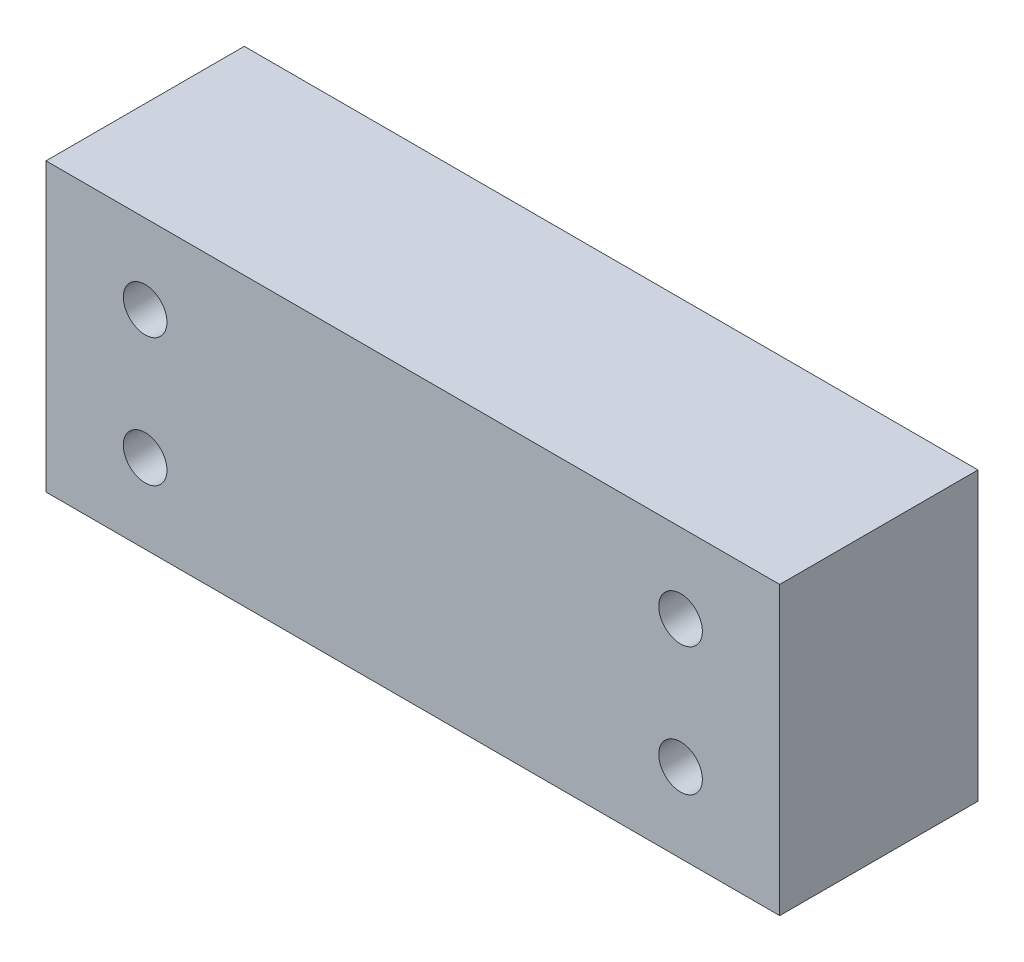
ISO-10303-21;
HEADER;
FILE_DESCRIPTION(('STEP AP214'),'2;1');
FILE_NAME('part.step','',(''),(''),'','','');
FILE_SCHEMA(('AUTOMOTIVE_DESIGN { 1 0 10303 214 1 1 1 1 }'));
ENDSEC;
DATA;
#1=APPLICATION_CONTEXT('core data for automotive mechanical design processes');
#2=APPLICATION_PROTOCOL_DEFINITION('international standard','automotive_design',2000,#1);
#3=PRODUCT_CONTEXT('',#1,'mechanical');
#4=PRODUCT('Part','Part','',(#3));
#5=PRODUCT_RELATED_PRODUCT_CATEGORY('part','',(#4));
#6=PRODUCT_DEFINITION_FORMATION('','',#4);
#7=PRODUCT_DEFINITION_CONTEXT('part definition',#1,'design');
#8=PRODUCT_DEFINITION('design','',#6,#7);
#9=PRODUCT_DEFINITION_SHAPE('','',#8);
#10=(LENGTH_UNIT() NAMED_UNIT(*) SI_UNIT(.MILLI.,.METRE.));
#11=(NAMED_UNIT(*) PLANE_ANGLE_UNIT() SI_UNIT($,.RADIAN.));
#12=(NAMED_UNIT(*) SI_UNIT($,.STERADIAN.) SOLID_ANGLE_UNIT());
#13=UNCERTAINTY_MEASURE_WITH_UNIT(LENGTH_MEASURE(1.E-05),#10,'distance_accuracy_value','');
#14=(GEOMETRIC_REPRESENTATION_CONTEXT(3) GLOBAL_UNCERTAINTY_ASSIGNED_CONTEXT((#13)) GLOBAL_UNIT_ASSIGNED_CONTEXT((#10,
#11,#12)) REPRESENTATION_CONTEXT('',''));
#15=CARTESIAN_POINT('',(0.,0.,0.));
#16=DIRECTION('',(0.,0.,1.));
#17=DIRECTION('',(1.,0.,0.));
#18=AXIS2_PLACEMENT_3D('',#15,#16,#17);
#19=CARTESIAN_POINT('',(0.,0.,15.));
#20=DIRECTION('',(0.,0.,-1.));
#21=DIRECTION('',(-1.,0.,0.));
#22=AXIS2_PLACEMENT_3D('',#19,#20,#21);
#23=PLANE('',#22);
#24=DIRECTION('',(0.,1.,0.));
#25=VECTOR('',#24,1.);
#26=CARTESIAN_POINT('',(27.75,-10.85,15.));
#27=LINE('',#26,#25);
#28=CARTESIAN_POINT('',(27.75,-10.85,15.));
#29=VERTEX_POINT('',#28);
#30=CARTESIAN_POINT('',(27.75,10.85,15.));
#31=VERTEX_POINT('',#30);
#32=EDGE_CURVE('E88',#29,#31,#27,.T.);
#33=ORIENTED_EDGE('',*,*,#32,.T.);
#34=DIRECTION('',(-1.,0.,0.));
#35=VECTOR('',#34,1.);
#36=CARTESIAN_POINT('',(-27.75,10.85,15.));
#37=LINE('',#36,#35);
#38=CARTESIAN_POINT('',(-27.75,10.85,15.));
#39=VERTEX_POINT('',#38);
#40=EDGE_CURVE('E83',#31,#39,#37,.T.);
#41=ORIENTED_EDGE('',*,*,#40,.T.);
#42=DIRECTION('',(0.,-1.,0.));
#43=VECTOR('',#42,1.);
#44=CARTESIAN_POINT('',(-27.75,-10.85,15.));
#45=LINE('',#44,#43);
#46=CARTESIAN_POINT('',(-27.75,-10.85,15.));
#47=VERTEX_POINT('',#46);
#48=EDGE_CURVE('E86',#39,#47,#45,.T.);
#49=ORIENTED_EDGE('',*,*,#48,.T.);
#50=DIRECTION('',(1.,0.,0.));
#51=VECTOR('',#50,1.);
#52=CARTESIAN_POINT('',(-27.75,-10.85,15.));
#53=LINE('',#52,#51);
#54=EDGE_CURVE('E53',#47,#29,#53,.T.);
#55=ORIENTED_EDGE('',*,*,#54,.T.);
#56=EDGE_LOOP('',(#33,#41,#49,#55));
#57=FACE_BOUND('',#56,.T.);
#58=CARTESIAN_POINT('',(20.25,4.85,15.));
#59=DIRECTION('',(0.,0.,1.));
#60=DIRECTION('',(1.,0.,0.));
#61=AXIS2_PLACEMENT_3D('',#58,#59,#60);
#62=CIRCLE('',#61,1.65);
#63=CARTESIAN_POINT('',(21.9,4.85,15.));
#64=VERTEX_POINT('',#63);
#65=EDGE_CURVE('E103',#64,#64,#62,.T.);
#66=ORIENTED_EDGE('',*,*,#65,.F.);
#67=EDGE_LOOP('',(#66));
#68=FACE_BOUND('',#67,.T.);
#69=CARTESIAN_POINT('',(-20.25,4.85,15.));
#70=DIRECTION('',(0.,0.,1.));
#71=DIRECTION('',(-1.,0.,0.));
#72=AXIS2_PLACEMENT_3D('',#69,#70,#71);
#73=CIRCLE('',#72,1.65);
#74=CARTESIAN_POINT('',(-21.9,4.85,15.));
#75=VERTEX_POINT('',#74);
#76=EDGE_CURVE('E118',#75,#75,#73,.T.);
#77=ORIENTED_EDGE('',*,*,#76,.F.);
#78=EDGE_LOOP('',(#77));
#79=FACE_BOUND('',#78,.T.);
#80=CARTESIAN_POINT('',(20.25,-4.85,15.));
#81=DIRECTION('',(0.,0.,1.));
#82=DIRECTION('',(-1.,0.,0.));
#83=AXIS2_PLACEMENT_3D('',#80,#81,#82);
#84=CIRCLE('',#83,1.65);
#85=CARTESIAN_POINT('',(18.6,-4.85,15.));
#86=VERTEX_POINT('',#85);
#87=EDGE_CURVE('E124',#86,#86,#84,.T.);
#88=ORIENTED_EDGE('',*,*,#87,.F.);
#89=EDGE_LOOP('',(#88));
#90=FACE_BOUND('',#89,.T.);
#91=CARTESIAN_POINT('',(-20.25,-4.85,15.));
#92=DIRECTION('',(0.,0.,1.));
#93=DIRECTION('',(1.,0.,0.));
#94=AXIS2_PLACEMENT_3D('',#91,#92,#93);
#95=CIRCLE('',#94,1.65);
#96=CARTESIAN_POINT('',(-18.6,-4.85,15.));
#97=VERTEX_POINT('',#96);
#98=EDGE_CURVE('E130',#97,#97,#95,.T.);
#99=ORIENTED_EDGE('',*,*,#98,.F.);
#100=EDGE_LOOP('',(#99));
#101=FACE_BOUND('',#100,.T.);
#102=ADVANCED_FACE('F36',(#57,#68,#79,#90,#101),#23,.F.);
#103=CARTESIAN_POINT('',(0.,0.,0.));
#104=DIRECTION('',(0.,0.,-1.));
#105=DIRECTION('',(-1.,0.,0.));
#106=AXIS2_PLACEMENT_3D('',#103,#104,#105);
#107=PLANE('',#106);
#108=CARTESIAN_POINT('',(20.25,-4.85,0.));
#109=DIRECTION('',(0.,0.,1.));
#110=DIRECTION('',(-1.,0.,0.));
#111=AXIS2_PLACEMENT_3D('',#108,#109,#110);
#112=CIRCLE('',#111,1.65);
#113=CARTESIAN_POINT('',(18.6,-4.85,0.));
#114=VERTEX_POINT('',#113);
#115=EDGE_CURVE('E127',#114,#114,#112,.T.);
#116=ORIENTED_EDGE('',*,*,#115,.T.);
#117=EDGE_LOOP('',(#116));
#118=FACE_BOUND('',#117,.T.);
#119=CARTESIAN_POINT('',(20.25,4.85,0.));
#120=DIRECTION('',(0.,0.,1.));
#121=DIRECTION('',(1.,0.,0.));
#122=AXIS2_PLACEMENT_3D('',#119,#120,#121);
#123=CIRCLE('',#122,1.65);
#124=CARTESIAN_POINT('',(21.9,4.85,0.));
#125=VERTEX_POINT('',#124);
#126=EDGE_CURVE('E115',#125,#125,#123,.T.);
#127=ORIENTED_EDGE('',*,*,#126,.T.);
#128=EDGE_LOOP('',(#127));
#129=FACE_BOUND('',#128,.T.);
#130=DIRECTION('',(0.,1.,0.));
#131=VECTOR('',#130,1.);
#132=CARTESIAN_POINT('',(27.75,-10.85,0.));
#133=LINE('',#132,#131);
#134=CARTESIAN_POINT('',(27.75,-10.85,0.));
#135=VERTEX_POINT('',#134);
#136=CARTESIAN_POINT('',(27.75,10.85,0.));
#137=VERTEX_POINT('',#136);
#138=EDGE_CURVE('E100',#135,#137,#133,.T.);
#139=ORIENTED_EDGE('',*,*,#138,.F.);
#140=DIRECTION('',(1.,0.,0.));
#141=VECTOR('',#140,1.);
#142=CARTESIAN_POINT('',(-27.75,-10.85,0.));
#143=LINE('',#142,#141);
#144=CARTESIAN_POINT('',(-27.75,-10.85,0.));
#145=VERTEX_POINT('',#144);
#146=EDGE_CURVE('E76',#145,#135,#143,.T.);
#147=ORIENTED_EDGE('',*,*,#146,.F.);
#148=DIRECTION('',(0.,-1.,0.));
#149=VECTOR('',#148,1.);
#150=CARTESIAN_POINT('',(-27.75,-10.85,0.));
#151=LINE('',#150,#149);
#152=CARTESIAN_POINT('',(-27.75,10.85,0.));
#153=VERTEX_POINT('',#152);
#154=EDGE_CURVE('E70',#153,#145,#151,.T.);
#155=ORIENTED_EDGE('',*,*,#154,.F.);
#156=DIRECTION('',(-1.,0.,0.));
#157=VECTOR('',#156,1.);
#158=CARTESIAN_POINT('',(-27.75,10.85,0.));
#159=LINE('',#158,#157);
#160=EDGE_CURVE('E92',#137,#153,#159,.T.);
#161=ORIENTED_EDGE('',*,*,#160,.F.);
#162=EDGE_LOOP('',(#139,#147,#155,#161));
#163=FACE_BOUND('',#162,.T.);
#164=CARTESIAN_POINT('',(-20.25,4.85,0.));
#165=DIRECTION('',(0.,0.,1.));
#166=DIRECTION('',(-1.,0.,0.));
#167=AXIS2_PLACEMENT_3D('',#164,#165,#166);
#168=CIRCLE('',#167,1.65);
#169=CARTESIAN_POINT('',(-21.9,4.85,0.));
#170=VERTEX_POINT('',#169);
#171=EDGE_CURVE('E121',#170,#170,#168,.T.);
#172=ORIENTED_EDGE('',*,*,#171,.T.);
#173=EDGE_LOOP('',(#172));
#174=FACE_BOUND('',#173,.T.);
#175=CARTESIAN_POINT('',(-20.25,-4.85,0.));
#176=DIRECTION('',(0.,0.,1.));
#177=DIRECTION('',(1.,0.,0.));
#178=AXIS2_PLACEMENT_3D('',#175,#176,#177);
#179=CIRCLE('',#178,1.65);
#180=CARTESIAN_POINT('',(-18.6,-4.85,0.));
#181=VERTEX_POINT('',#180);
#182=EDGE_CURVE('E133',#181,#181,#179,.T.);
#183=ORIENTED_EDGE('',*,*,#182,.T.);
#184=EDGE_LOOP('',(#183));
#185=FACE_BOUND('',#184,.T.);
#186=ADVANCED_FACE('F111',(#118,#129,#163,#174,#185),#107,.T.);
#187=CARTESIAN_POINT('',(27.75,-10.85,15.));
#188=DIRECTION('',(-1.,0.,0.));
#189=DIRECTION('',(0.,0.,1.));
#190=AXIS2_PLACEMENT_3D('',#187,#188,#189);
#191=PLANE('',#190);
#192=ORIENTED_EDGE('',*,*,#138,.T.);
#193=DIRECTION('',(0.,0.,-1.));
#194=VECTOR('',#193,1.);
#195=CARTESIAN_POINT('',(27.75,10.85,15.));
#196=LINE('',#195,#194);
#197=EDGE_CURVE('E11',#31,#137,#196,.T.);
#198=ORIENTED_EDGE('',*,*,#197,.F.);
#199=ORIENTED_EDGE('',*,*,#32,.F.);
#200=DIRECTION('',(0.,0.,-1.));
#201=VECTOR('',#200,1.);
#202=CARTESIAN_POINT('',(27.75,-10.85,15.));
#203=LINE('',#202,#201);
#204=EDGE_CURVE('E96',#29,#135,#203,.T.);
#205=ORIENTED_EDGE('',*,*,#204,.T.);
#206=EDGE_LOOP('',(#192,#198,#199,#205));
#207=FACE_BOUND('',#206,.T.);
#208=ADVANCED_FACE('F38',(#207),#191,.F.);
#209=CARTESIAN_POINT('',(-27.75,10.85,15.));
#210=DIRECTION('',(0.,-1.,0.));
#211=DIRECTION('',(0.,0.,-1.));
#212=AXIS2_PLACEMENT_3D('',#209,#210,#211);
#213=PLANE('',#212);
#214=ORIENTED_EDGE('',*,*,#160,.T.);
#215=DIRECTION('',(0.,0.,-1.));
#216=VECTOR('',#215,1.);
#217=CARTESIAN_POINT('',(-27.75,10.85,15.));
#218=LINE('',#217,#216);
#219=EDGE_CURVE('E45',#39,#153,#218,.T.);
#220=ORIENTED_EDGE('',*,*,#219,.F.);
#221=ORIENTED_EDGE('',*,*,#40,.F.);
#222=ORIENTED_EDGE('',*,*,#197,.T.);
#223=EDGE_LOOP('',(#214,#220,#221,#222));
#224=FACE_BOUND('',#223,.T.);
#225=ADVANCED_FACE('F91',(#224),#213,.F.);
#226=CARTESIAN_POINT('',(-27.75,-10.85,15.));
#227=DIRECTION('',(1.,0.,0.));
#228=DIRECTION('',(0.,0.,-1.));
#229=AXIS2_PLACEMENT_3D('',#226,#227,#228);
#230=PLANE('',#229);
#231=ORIENTED_EDGE('',*,*,#154,.T.);
#232=DIRECTION('',(0.,0.,-1.));
#233=VECTOR('',#232,1.);
#234=CARTESIAN_POINT('',(-27.75,-10.85,15.));
#235=LINE('',#234,#233);
#236=EDGE_CURVE('E93',#47,#145,#235,.T.);
#237=ORIENTED_EDGE('',*,*,#236,.F.);
#238=ORIENTED_EDGE('',*,*,#48,.F.);
#239=ORIENTED_EDGE('',*,*,#219,.T.);
#240=EDGE_LOOP('',(#231,#237,#238,#239));
#241=FACE_BOUND('',#240,.T.);
#242=ADVANCED_FACE('F94',(#241),#230,.F.);
#243=CARTESIAN_POINT('',(-27.75,-10.85,15.));
#244=DIRECTION('',(0.,1.,0.));
#245=DIRECTION('',(0.,0.,1.));
#246=AXIS2_PLACEMENT_3D('',#243,#244,#245);
#247=PLANE('',#246);
#248=ORIENTED_EDGE('',*,*,#146,.T.);
#249=ORIENTED_EDGE('',*,*,#204,.F.);
#250=ORIENTED_EDGE('',*,*,#54,.F.);
#251=ORIENTED_EDGE('',*,*,#236,.T.);
#252=EDGE_LOOP('',(#248,#249,#250,#251));
#253=FACE_BOUND('',#252,.T.);
#254=ADVANCED_FACE('F108',(#253),#247,.F.);
#255=CARTESIAN_POINT('',(20.25,4.85,15.));
#256=DIRECTION('',(0.,0.,-1.));
#257=DIRECTION('',(-1.,0.,0.));
#258=AXIS2_PLACEMENT_3D('',#255,#256,#257);
#259=CYLINDRICAL_SURFACE('',#258,1.65);
#260=ORIENTED_EDGE('',*,*,#65,.T.);
#261=EDGE_LOOP('',(#260));
#262=FACE_BOUND('',#261,.T.);
#263=ORIENTED_EDGE('',*,*,#126,.F.);
#264=EDGE_LOOP('',(#263));
#265=FACE_BOUND('',#264,.T.);
#266=ADVANCED_FACE('F150',(#262,#265),#259,.F.);
#267=CARTESIAN_POINT('',(-20.25,4.85,15.));
#268=DIRECTION('',(0.,0.,-1.));
#269=DIRECTION('',(-1.,0.,0.));
#270=AXIS2_PLACEMENT_3D('',#267,#268,#269);
#271=CYLINDRICAL_SURFACE('',#270,1.65);
#272=ORIENTED_EDGE('',*,*,#76,.T.);
#273=EDGE_LOOP('',(#272));
#274=FACE_BOUND('',#273,.T.);
#275=ORIENTED_EDGE('',*,*,#171,.F.);
#276=EDGE_LOOP('',(#275));
#277=FACE_BOUND('',#276,.T.);
#278=ADVANCED_FACE('F204',(#274,#277),#271,.F.);
#279=CARTESIAN_POINT('',(20.25,-4.85,15.));
#280=DIRECTION('',(0.,0.,-1.));
#281=DIRECTION('',(-1.,0.,0.));
#282=AXIS2_PLACEMENT_3D('',#279,#280,#281);
#283=CYLINDRICAL_SURFACE('',#282,1.65);
#284=ORIENTED_EDGE('',*,*,#87,.T.);
#285=EDGE_LOOP('',(#284));
#286=FACE_BOUND('',#285,.T.);
#287=ORIENTED_EDGE('',*,*,#115,.F.);
#288=EDGE_LOOP('',(#287));
#289=FACE_BOUND('',#288,.T.);
#290=ADVANCED_FACE('F213',(#286,#289),#283,.F.);
#291=CARTESIAN_POINT('',(-20.25,-4.85,15.));
#292=DIRECTION('',(0.,0.,-1.));
#293=DIRECTION('',(-1.,0.,0.));
#294=AXIS2_PLACEMENT_3D('',#291,#292,#293);
#295=CYLINDRICAL_SURFACE('',#294,1.65);
#296=ORIENTED_EDGE('',*,*,#98,.T.);
#297=EDGE_LOOP('',(#296));
#298=FACE_BOUND('',#297,.T.);
#299=ORIENTED_EDGE('',*,*,#182,.F.);
#300=EDGE_LOOP('',(#299));
#301=FACE_BOUND('',#300,.T.);
#302=ADVANCED_FACE('F139',(#298,#301),#295,.F.);
#303=CLOSED_SHELL('',(#102,#186,#208,#225,#242,#254,#266,#278,#290,#302));
#304=MANIFOLD_SOLID_BREP('B2',#303);
#305=ADVANCED_BREP_SHAPE_REPRESENTATION('',(#18,#304),#14);
#306=SHAPE_DEFINITION_REPRESENTATION(#9,#305);
ENDSEC;
END-ISO-10303-21;
